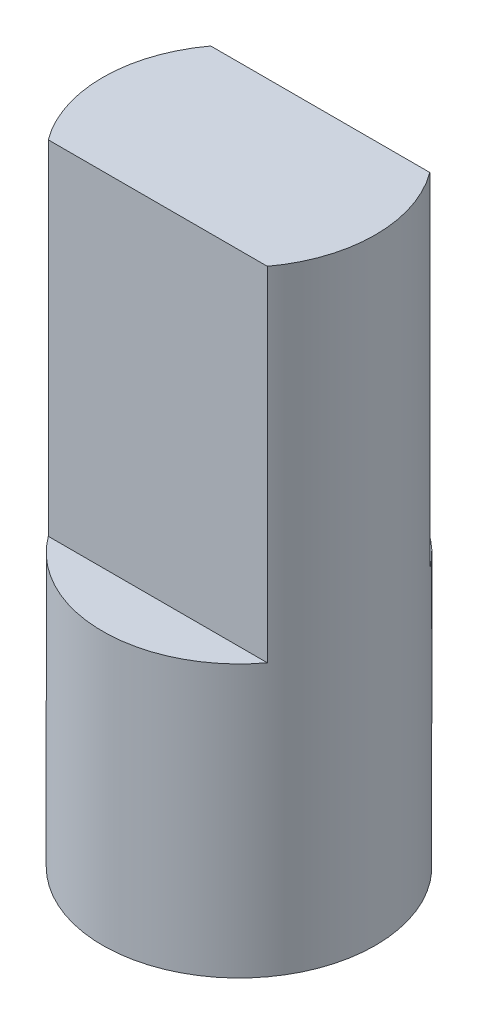
ISO-10303-21;
HEADER;
FILE_DESCRIPTION(('STEP AP214'),'2;1');
FILE_NAME('part.step','',(''),(''),'','','');
FILE_SCHEMA(('AUTOMOTIVE_DESIGN { 1 0 10303 214 1 1 1 1 }'));
ENDSEC;
DATA;
#1=APPLICATION_CONTEXT('core data for automotive mechanical design processes');
#2=APPLICATION_PROTOCOL_DEFINITION('international standard','automotive_design',2000,#1);
#3=PRODUCT_CONTEXT('',#1,'mechanical');
#4=PRODUCT('Part','Part','',(#3));
#5=PRODUCT_RELATED_PRODUCT_CATEGORY('part','',(#4));
#6=PRODUCT_DEFINITION_FORMATION('','',#4);
#7=PRODUCT_DEFINITION_CONTEXT('part definition',#1,'design');
#8=PRODUCT_DEFINITION('design','',#6,#7);
#9=PRODUCT_DEFINITION_SHAPE('','',#8);
#10=(LENGTH_UNIT() NAMED_UNIT(*) SI_UNIT(.MILLI.,.METRE.));
#11=(NAMED_UNIT(*) PLANE_ANGLE_UNIT() SI_UNIT($,.RADIAN.));
#12=(NAMED_UNIT(*) SI_UNIT($,.STERADIAN.) SOLID_ANGLE_UNIT());
#13=UNCERTAINTY_MEASURE_WITH_UNIT(LENGTH_MEASURE(1.E-05),#10,'distance_accuracy_value','');
#14=(GEOMETRIC_REPRESENTATION_CONTEXT(3) GLOBAL_UNCERTAINTY_ASSIGNED_CONTEXT((#13)) GLOBAL_UNIT_ASSIGNED_CONTEXT((#10,
#11,#12)) REPRESENTATION_CONTEXT('',''));
#15=CARTESIAN_POINT('',(0.,0.,0.));
#16=DIRECTION('',(0.,0.,1.));
#17=DIRECTION('',(1.,0.,0.));
#18=AXIS2_PLACEMENT_3D('',#15,#16,#17);
#19=CARTESIAN_POINT('',(-1.96845903183175,-6.1722,-1.4605));
#20=DIRECTION('',(0.,0.,-1.));
#21=DIRECTION('',(-1.,0.,0.));
#22=AXIS2_PLACEMENT_3D('',#19,#20,#21);
#23=PLANE('',#22);
#24=DIRECTION('',(-1.,0.,0.));
#25=VECTOR('',#24,1.);
#26=CARTESIAN_POINT('',(-1.96845903183175,0.,-1.4605));
#27=LINE('',#26,#25);
#28=CARTESIAN_POINT('',(1.96845903183175,0.,-1.4605));
#29=VERTEX_POINT('',#28);
#30=CARTESIAN_POINT('',(-1.96845903183175,0.,-1.4605));
#31=VERTEX_POINT('',#30);
#32=EDGE_CURVE('E93',#29,#31,#27,.T.);
#33=ORIENTED_EDGE('',*,*,#32,.F.);
#34=DIRECTION('',(0.,1.,0.));
#35=VECTOR('',#34,1.);
#36=CARTESIAN_POINT('',(1.96845903183175,-6.1722,-1.4605));
#37=LINE('',#36,#35);
#38=CARTESIAN_POINT('',(1.96845903183175,-6.1722,-1.4605));
#39=VERTEX_POINT('',#38);
#40=EDGE_CURVE('E51',#39,#29,#37,.T.);
#41=ORIENTED_EDGE('',*,*,#40,.F.);
#42=DIRECTION('',(-1.,0.,0.));
#43=VECTOR('',#42,1.);
#44=CARTESIAN_POINT('',(-1.96845903183175,-6.1722,-1.4605));
#45=LINE('',#44,#43);
#46=CARTESIAN_POINT('',(-1.96845903183175,-6.1722,-1.4605));
#47=VERTEX_POINT('',#46);
#48=EDGE_CURVE('E101',#39,#47,#45,.T.);
#49=ORIENTED_EDGE('',*,*,#48,.T.);
#50=DIRECTION('',(0.,1.,0.));
#51=VECTOR('',#50,1.);
#52=CARTESIAN_POINT('',(-1.96845903183175,-6.1722,-1.4605));
#53=LINE('',#52,#51);
#54=EDGE_CURVE('E11',#47,#31,#53,.T.);
#55=ORIENTED_EDGE('',*,*,#54,.T.);
#56=EDGE_LOOP('',(#33,#41,#49,#55));
#57=FACE_BOUND('',#56,.T.);
#58=ADVANCED_FACE('F41',(#57),#23,.T.);
#59=CARTESIAN_POINT('',(0.,-6.1722,0.));
#60=DIRECTION('',(0.,1.,0.));
#61=DIRECTION('',(0.,0.,1.));
#62=AXIS2_PLACEMENT_3D('',#59,#60,#61);
#63=CYLINDRICAL_SURFACE('',#62,2.4511);
#64=CARTESIAN_POINT('',(0.,0.,0.));
#65=DIRECTION('',(0.,1.,0.));
#66=DIRECTION('',(0.,0.,1.));
#67=AXIS2_PLACEMENT_3D('',#64,#65,#66);
#68=CIRCLE('',#67,2.4511);
#69=CARTESIAN_POINT('',(1.96845903183175,0.,1.4605));
#70=VERTEX_POINT('',#69);
#71=EDGE_CURVE('E78',#70,#29,#68,.T.);
#72=ORIENTED_EDGE('',*,*,#71,.F.);
#73=DIRECTION('',(0.,1.,0.));
#74=VECTOR('',#73,1.);
#75=CARTESIAN_POINT('',(1.96845903183175,-6.1722,1.4605));
#76=LINE('',#75,#74);
#77=CARTESIAN_POINT('',(1.96845903183175,-6.1722,1.4605));
#78=VERTEX_POINT('',#77);
#79=EDGE_CURVE('E87',#78,#70,#76,.T.);
#80=ORIENTED_EDGE('',*,*,#79,.F.);
#81=CARTESIAN_POINT('',(0.,-6.1722,0.));
#82=DIRECTION('',(0.,-1.,0.));
#83=DIRECTION('',(0.,0.,-1.));
#84=AXIS2_PLACEMENT_3D('',#81,#82,#83);
#85=CIRCLE('',#84,2.4511);
#86=CARTESIAN_POINT('',(-1.96845903183175,-6.1722,1.4605));
#87=VERTEX_POINT('',#86);
#88=EDGE_CURVE('E58',#78,#87,#85,.T.);
#89=ORIENTED_EDGE('',*,*,#88,.T.);
#90=DIRECTION('',(0.,1.,0.));
#91=VECTOR('',#90,1.);
#92=CARTESIAN_POINT('',(-1.96845903183175,-6.1722,1.4605));
#93=LINE('',#92,#91);
#94=CARTESIAN_POINT('',(-1.96845903183175,0.,1.4605));
#95=VERTEX_POINT('',#94);
#96=EDGE_CURVE('E45',#87,#95,#93,.T.);
#97=ORIENTED_EDGE('',*,*,#96,.T.);
#98=CARTESIAN_POINT('',(0.,0.,0.));
#99=DIRECTION('',(0.,1.,0.));
#100=DIRECTION('',(0.,0.,1.));
#101=AXIS2_PLACEMENT_3D('',#98,#99,#100);
#102=CIRCLE('',#101,2.4511);
#103=EDGE_CURVE('E110',#31,#95,#102,.T.);
#104=ORIENTED_EDGE('',*,*,#103,.F.);
#105=ORIENTED_EDGE('',*,*,#54,.F.);
#106=EDGE_CURVE('E83',#47,#39,#85,.T.);
#107=ORIENTED_EDGE('',*,*,#106,.T.);
#108=ORIENTED_EDGE('',*,*,#40,.T.);
#109=EDGE_LOOP('',(#72,#80,#89,#97,#104,#105,#107,#108));
#110=FACE_BOUND('',#109,.T.);
#111=CARTESIAN_POINT('',(0.,-11.0617,0.));
#112=DIRECTION('',(0.,-1.,0.));
#113=DIRECTION('',(0.,0.,-1.));
#114=AXIS2_PLACEMENT_3D('',#111,#112,#113);
#115=CIRCLE('',#114,2.4511);
#116=CARTESIAN_POINT('',(0.,-11.0617,-2.4511));
#117=VERTEX_POINT('',#116);
#118=EDGE_CURVE('E111',#117,#117,#115,.T.);
#119=ORIENTED_EDGE('',*,*,#118,.F.);
#120=EDGE_LOOP('',(#119));
#121=FACE_BOUND('',#120,.T.);
#122=ADVANCED_FACE('F76',(#110,#121),#63,.T.);
#123=CARTESIAN_POINT('',(1.96845903183175,-6.1722,1.4605));
#124=DIRECTION('',(0.,0.,1.));
#125=DIRECTION('',(1.,0.,0.));
#126=AXIS2_PLACEMENT_3D('',#123,#124,#125);
#127=PLANE('',#126);
#128=DIRECTION('',(1.,0.,0.));
#129=VECTOR('',#128,1.);
#130=CARTESIAN_POINT('',(1.96845903183175,0.,1.4605));
#131=LINE('',#130,#129);
#132=EDGE_CURVE('E95',#95,#70,#131,.T.);
#133=ORIENTED_EDGE('',*,*,#132,.F.);
#134=ORIENTED_EDGE('',*,*,#96,.F.);
#135=DIRECTION('',(1.,0.,0.));
#136=VECTOR('',#135,1.);
#137=CARTESIAN_POINT('',(1.96845903183175,-6.1722,1.4605));
#138=LINE('',#137,#136);
#139=EDGE_CURVE('E98',#87,#78,#138,.T.);
#140=ORIENTED_EDGE('',*,*,#139,.T.);
#141=ORIENTED_EDGE('',*,*,#79,.T.);
#142=EDGE_LOOP('',(#133,#134,#140,#141));
#143=FACE_BOUND('',#142,.T.);
#144=ADVANCED_FACE('F43',(#143),#127,.T.);
#145=CARTESIAN_POINT('',(0.,0.,0.));
#146=DIRECTION('',(0.,1.,0.));
#147=DIRECTION('',(0.,0.,1.));
#148=AXIS2_PLACEMENT_3D('',#145,#146,#147);
#149=PLANE('',#148);
#150=ORIENTED_EDGE('',*,*,#103,.T.);
#151=ORIENTED_EDGE('',*,*,#132,.T.);
#152=ORIENTED_EDGE('',*,*,#71,.T.);
#153=ORIENTED_EDGE('',*,*,#32,.T.);
#154=EDGE_LOOP('',(#150,#151,#152,#153));
#155=FACE_BOUND('',#154,.T.);
#156=ADVANCED_FACE('F92',(#155),#149,.T.);
#157=CARTESIAN_POINT('',(0.,-6.1722,0.));
#158=DIRECTION('',(0.,-1.,0.));
#159=DIRECTION('',(0.,0.,-1.));
#160=AXIS2_PLACEMENT_3D('',#157,#158,#159);
#161=PLANE('',#160);
#162=ORIENTED_EDGE('',*,*,#48,.F.);
#163=ORIENTED_EDGE('',*,*,#106,.F.);
#164=EDGE_LOOP('',(#162,#163));
#165=FACE_BOUND('',#164,.T.);
#166=ADVANCED_FACE('F121',(#165),#161,.F.);
#167=CARTESIAN_POINT('',(0.,-11.0617,0.));
#168=DIRECTION('',(0.,-1.,0.));
#169=DIRECTION('',(0.,0.,-1.));
#170=AXIS2_PLACEMENT_3D('',#167,#168,#169);
#171=PLANE('',#170);
#172=ORIENTED_EDGE('',*,*,#118,.T.);
#173=EDGE_LOOP('',(#172));
#174=FACE_BOUND('',#173,.T.);
#175=ADVANCED_FACE('F119',(#174),#171,.T.);
#176=ORIENTED_EDGE('',*,*,#139,.F.);
#177=ORIENTED_EDGE('',*,*,#88,.F.);
#178=EDGE_LOOP('',(#176,#177));
#179=FACE_BOUND('',#178,.T.);
#180=ADVANCED_FACE('F117',(#179),#161,.F.);
#181=CLOSED_SHELL('',(#58,#122,#144,#156,#166,#175,#180));
#182=MANIFOLD_SOLID_BREP('B2',#181);
#183=ADVANCED_BREP_SHAPE_REPRESENTATION('',(#18,#182),#14);
#184=SHAPE_DEFINITION_REPRESENTATION(#9,#183);
ENDSEC;
END-ISO-10303-21;
